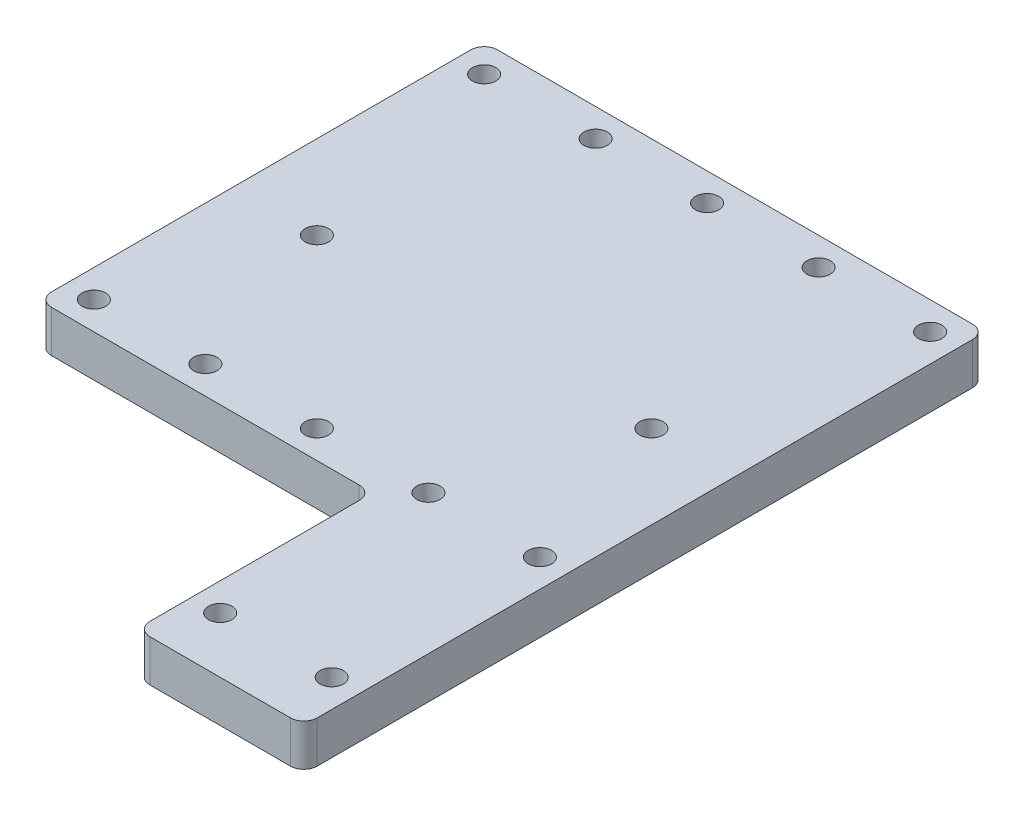
ISO-10303-21;
HEADER;
FILE_DESCRIPTION(('STEP AP214'),'2;1');
FILE_NAME('part.step','',(''),(''),'','','');
FILE_SCHEMA(('AUTOMOTIVE_DESIGN { 1 0 10303 214 1 1 1 1 }'));
ENDSEC;
DATA;
#1=APPLICATION_CONTEXT('core data for automotive mechanical design processes');
#2=APPLICATION_PROTOCOL_DEFINITION('international standard','automotive_design',2000,#1);
#3=PRODUCT_CONTEXT('',#1,'mechanical');
#4=PRODUCT('Part','Part','',(#3));
#5=PRODUCT_RELATED_PRODUCT_CATEGORY('part','',(#4));
#6=PRODUCT_DEFINITION_FORMATION('','',#4);
#7=PRODUCT_DEFINITION_CONTEXT('part definition',#1,'design');
#8=PRODUCT_DEFINITION('design','',#6,#7);
#9=PRODUCT_DEFINITION_SHAPE('','',#8);
#10=(LENGTH_UNIT() NAMED_UNIT(*) SI_UNIT(.MILLI.,.METRE.));
#11=(NAMED_UNIT(*) PLANE_ANGLE_UNIT() SI_UNIT($,.RADIAN.));
#12=(NAMED_UNIT(*) SI_UNIT($,.STERADIAN.) SOLID_ANGLE_UNIT());
#13=UNCERTAINTY_MEASURE_WITH_UNIT(LENGTH_MEASURE(1.E-05),#10,'distance_accuracy_value','');
#14=(GEOMETRIC_REPRESENTATION_CONTEXT(3) GLOBAL_UNCERTAINTY_ASSIGNED_CONTEXT((#13)) GLOBAL_UNIT_ASSIGNED_CONTEXT((#10,
#11,#12)) REPRESENTATION_CONTEXT('',''));
#15=CARTESIAN_POINT('',(0.,0.,0.));
#16=DIRECTION('',(0.,0.,1.));
#17=DIRECTION('',(1.,0.,0.));
#18=AXIS2_PLACEMENT_3D('',#15,#16,#17);
#19=CARTESIAN_POINT('',(0.,9.525,0.));
#20=DIRECTION('',(0.,1.,0.));
#21=DIRECTION('',(0.,0.,1.));
#22=AXIS2_PLACEMENT_3D('',#19,#20,#21);
#23=PLANE('',#22);
#24=CARTESIAN_POINT('',(4.25007251614318E-13,9.525,-21.2661500000001));
#25=DIRECTION('',(0.,1.,0.));
#26=DIRECTION('',(0.,0.,1.));
#27=AXIS2_PLACEMENT_3D('',#24,#25,#26);
#28=CIRCLE('',#27,2.667);
#29=CARTESIAN_POINT('',(4.25007251614318E-13,9.525,-18.5991500000001));
#30=VERTEX_POINT('',#29);
#31=EDGE_CURVE('E153',#30,#30,#28,.F.);
#32=ORIENTED_EDGE('',*,*,#31,.T.);
#33=EDGE_LOOP('',(#32));
#34=FACE_BOUND('',#33,.T.);
#35=CARTESIAN_POINT('',(-76.1999999999996,9.525,-21.2661500000005));
#36=DIRECTION('',(0.,1.,0.));
#37=DIRECTION('',(0.,0.,1.));
#38=AXIS2_PLACEMENT_3D('',#35,#36,#37);
#39=CIRCLE('',#38,2.667);
#40=CARTESIAN_POINT('',(-76.1999999999996,9.525,-18.5991500000005));
#41=VERTEX_POINT('',#40);
#42=EDGE_CURVE('E616',#41,#41,#39,.F.);
#43=ORIENTED_EDGE('',*,*,#42,.T.);
#44=EDGE_LOOP('',(#43));
#45=FACE_BOUND('',#44,.T.);
#46=CARTESIAN_POINT('',(-22.098,9.52500000000001,26.2318500000016));
#47=DIRECTION('',(0.,1.,0.));
#48=DIRECTION('',(0.,0.,1.));
#49=AXIS2_PLACEMENT_3D('',#46,#47,#48);
#50=CIRCLE('',#49,3.048);
#51=CARTESIAN_POINT('',(-22.098,9.52500000000001,23.1838500000016));
#52=VERTEX_POINT('',#51);
#53=CARTESIAN_POINT('',(-19.05,9.52500000000001,26.2318500000016));
#54=VERTEX_POINT('',#53);
#55=EDGE_CURVE('E341',#52,#54,#50,.F.);
#56=ORIENTED_EDGE('',*,*,#55,.T.);
#57=DIRECTION('',(0.,0.,1.));
#58=VECTOR('',#57,1.);
#59=CARTESIAN_POINT('',(-19.05,9.525,-78.41615));
#60=LINE('',#59,#58);
#61=CARTESIAN_POINT('',(-19.05,9.525,73.90765));
#62=VERTEX_POINT('',#61);
#63=EDGE_CURVE('E142',#54,#62,#60,.T.);
#64=ORIENTED_EDGE('',*,*,#63,.T.);
#65=CARTESIAN_POINT('',(-16.0019999999999,9.525,73.90765));
#66=DIRECTION('',(0.,1.,0.));
#67=DIRECTION('',(0.,0.,1.));
#68=AXIS2_PLACEMENT_3D('',#65,#66,#67);
#69=CIRCLE('',#68,3.04800000000007);
#70=CARTESIAN_POINT('',(-16.0019999999999,9.525,76.95565));
#71=VERTEX_POINT('',#70);
#72=EDGE_CURVE('E182',#62,#71,#69,.T.);
#73=ORIENTED_EDGE('',*,*,#72,.T.);
#74=DIRECTION('',(1.,0.,0.));
#75=VECTOR('',#74,1.);
#76=CARTESIAN_POINT('',(0.,9.525,76.95565));
#77=LINE('',#76,#75);
#78=CARTESIAN_POINT('',(16.0020000000001,9.525,76.95565));
#79=VERTEX_POINT('',#78);
#80=EDGE_CURVE('E190',#71,#79,#77,.T.);
#81=ORIENTED_EDGE('',*,*,#80,.T.);
#82=CARTESIAN_POINT('',(16.0020000000001,9.525,73.90765));
#83=DIRECTION('',(0.,1.,0.));
#84=DIRECTION('',(0.,0.,1.));
#85=AXIS2_PLACEMENT_3D('',#82,#83,#84);
#86=CIRCLE('',#85,3.04799999999995);
#87=CARTESIAN_POINT('',(19.05,9.525,73.90765));
#88=VERTEX_POINT('',#87);
#89=EDGE_CURVE('E186',#88,#79,#86,.F.);
#90=ORIENTED_EDGE('',*,*,#89,.F.);
#91=DIRECTION('',(0.,0.,-1.));
#92=VECTOR('',#91,1.);
#93=CARTESIAN_POINT('',(19.05,9.525,-78.41615));
#94=LINE('',#93,#92);
#95=CARTESIAN_POINT('',(19.05,9.525,-75.36815));
#96=VERTEX_POINT('',#95);
#97=EDGE_CURVE('E64',#88,#96,#94,.T.);
#98=ORIENTED_EDGE('',*,*,#97,.T.);
#99=CARTESIAN_POINT('',(16.002,9.525,-75.36815));
#100=DIRECTION('',(0.,1.,0.));
#101=DIRECTION('',(0.,0.,1.));
#102=AXIS2_PLACEMENT_3D('',#99,#100,#101);
#103=CIRCLE('',#102,3.048);
#104=CARTESIAN_POINT('',(16.002,9.525,-78.41615));
#105=VERTEX_POINT('',#104);
#106=EDGE_CURVE('E136',#96,#105,#103,.T.);
#107=ORIENTED_EDGE('',*,*,#106,.T.);
#108=DIRECTION('',(-1.,0.,0.));
#109=VECTOR('',#108,1.);
#110=CARTESIAN_POINT('',(-19.05,9.525,-78.41615));
#111=LINE('',#110,#109);
#112=CARTESIAN_POINT('',(-92.202,9.52500000000001,-78.4161500000005));
#113=VERTEX_POINT('',#112);
#114=EDGE_CURVE('E129',#105,#113,#111,.T.);
#115=ORIENTED_EDGE('',*,*,#114,.T.);
#116=CARTESIAN_POINT('',(-92.202,9.52500000000001,-75.3681500000001));
#117=DIRECTION('',(0.,1.,0.));
#118=DIRECTION('',(0.,0.,1.));
#119=AXIS2_PLACEMENT_3D('',#116,#117,#118);
#120=CIRCLE('',#119,3.04800000000035);
#121=CARTESIAN_POINT('',(-95.25,9.52500000000001,-75.3681499999998));
#122=VERTEX_POINT('',#121);
#123=EDGE_CURVE('E134',#122,#113,#120,.F.);
#124=ORIENTED_EDGE('',*,*,#123,.F.);
#125=DIRECTION('',(0.,0.,1.));
#126=VECTOR('',#125,1.);
#127=CARTESIAN_POINT('',(-95.25,9.52500000000001,0.));
#128=LINE('',#127,#126);
#129=CARTESIAN_POINT('',(-95.25,9.52500000000001,20.1358500000002));
#130=VERTEX_POINT('',#129);
#131=EDGE_CURVE('E344',#122,#130,#128,.T.);
#132=ORIENTED_EDGE('',*,*,#131,.T.);
#133=CARTESIAN_POINT('',(-92.2020000000002,9.52500000000001,20.1358500000002));
#134=DIRECTION('',(0.,1.,0.));
#135=DIRECTION('',(0.,0.,1.));
#136=AXIS2_PLACEMENT_3D('',#133,#134,#135);
#137=CIRCLE('',#136,3.04800000000001);
#138=CARTESIAN_POINT('',(-92.2020000000002,9.52500000000001,23.1838500000015));
#139=VERTEX_POINT('',#138);
#140=EDGE_CURVE('E348',#130,#139,#137,.T.);
#141=ORIENTED_EDGE('',*,*,#140,.T.);
#142=DIRECTION('',(-1.,0.,0.));
#143=VECTOR('',#142,1.);
#144=CARTESIAN_POINT('',(0.,9.52500000000001,23.1838500000016));
#145=LINE('',#144,#143);
#146=EDGE_CURVE('E173',#52,#139,#145,.T.);
#147=ORIENTED_EDGE('',*,*,#146,.F.);
#148=EDGE_LOOP('',(#56,#64,#73,#81,#90,#98,#107,#115,#124,#132,#141,#147));
#149=FACE_BOUND('',#148,.T.);
#150=CARTESIAN_POINT('',(12.7,9.525,16.83385));
#151=DIRECTION('',(0.,1.,0.));
#152=DIRECTION('',(0.,0.,1.));
#153=AXIS2_PLACEMENT_3D('',#150,#151,#152);
#154=CIRCLE('',#153,2.667);
#155=CARTESIAN_POINT('',(12.7,9.525,19.50085));
#156=VERTEX_POINT('',#155);
#157=EDGE_CURVE('E211',#156,#156,#154,.T.);
#158=ORIENTED_EDGE('',*,*,#157,.F.);
#159=EDGE_LOOP('',(#158));
#160=FACE_BOUND('',#159,.T.);
#161=CARTESIAN_POINT('',(12.7,9.525,-72.06615));
#162=DIRECTION('',(0.,1.,0.));
#163=DIRECTION('',(0.,0.,1.));
#164=AXIS2_PLACEMENT_3D('',#161,#162,#163);
#165=CIRCLE('',#164,2.667);
#166=CARTESIAN_POINT('',(12.7,9.525,-69.39915));
#167=VERTEX_POINT('',#166);
#168=EDGE_CURVE('E216',#167,#167,#165,.T.);
#169=ORIENTED_EDGE('',*,*,#168,.F.);
#170=EDGE_LOOP('',(#169));
#171=FACE_BOUND('',#170,.T.);
#172=CARTESIAN_POINT('',(-12.7,9.525,-72.06615));
#173=DIRECTION('',(0.,1.,0.));
#174=DIRECTION('',(0.,0.,1.));
#175=AXIS2_PLACEMENT_3D('',#172,#173,#174);
#176=CIRCLE('',#175,2.667);
#177=CARTESIAN_POINT('',(-12.7,9.525,-69.39915));
#178=VERTEX_POINT('',#177);
#179=EDGE_CURVE('E220',#178,#178,#176,.T.);
#180=ORIENTED_EDGE('',*,*,#179,.F.);
#181=EDGE_LOOP('',(#180));
#182=FACE_BOUND('',#181,.T.);
#183=CARTESIAN_POINT('',(-12.7,9.525,64.25565));
#184=DIRECTION('',(0.,1.,0.));
#185=DIRECTION('',(0.,0.,1.));
#186=AXIS2_PLACEMENT_3D('',#183,#184,#185);
#187=CIRCLE('',#186,2.667);
#188=CARTESIAN_POINT('',(-12.7,9.525,66.92265));
#189=VERTEX_POINT('',#188);
#190=EDGE_CURVE('E210',#189,#189,#187,.T.);
#191=ORIENTED_EDGE('',*,*,#190,.F.);
#192=EDGE_LOOP('',(#191));
#193=FACE_BOUND('',#192,.T.);
#194=CARTESIAN_POINT('',(12.7,9.525,64.25565));
#195=DIRECTION('',(0.,1.,0.));
#196=DIRECTION('',(0.,0.,1.));
#197=AXIS2_PLACEMENT_3D('',#194,#195,#196);
#198=CIRCLE('',#197,2.667);
#199=CARTESIAN_POINT('',(12.7,9.525,66.92265));
#200=VERTEX_POINT('',#199);
#201=EDGE_CURVE('E198',#200,#200,#198,.T.);
#202=ORIENTED_EDGE('',*,*,#201,.F.);
#203=EDGE_LOOP('',(#202));
#204=FACE_BOUND('',#203,.T.);
#205=CARTESIAN_POINT('',(-12.7,9.525,16.83385));
#206=DIRECTION('',(0.,1.,0.));
#207=DIRECTION('',(0.,0.,1.));
#208=AXIS2_PLACEMENT_3D('',#205,#206,#207);
#209=CIRCLE('',#208,2.667);
#210=CARTESIAN_POINT('',(-12.7,9.525,19.50085));
#211=VERTEX_POINT('',#210);
#212=EDGE_CURVE('E215',#211,#211,#209,.T.);
#213=ORIENTED_EDGE('',*,*,#212,.F.);
#214=EDGE_LOOP('',(#213));
#215=FACE_BOUND('',#214,.T.);
#216=CARTESIAN_POINT('',(-63.5,9.52500000000001,16.8338499999996));
#217=DIRECTION('',(0.,1.,0.));
#218=DIRECTION('',(0.,0.,1.));
#219=AXIS2_PLACEMENT_3D('',#216,#217,#218);
#220=CIRCLE('',#219,2.667);
#221=CARTESIAN_POINT('',(-63.5,9.52500000000001,19.5008499999996));
#222=VERTEX_POINT('',#221);
#223=EDGE_CURVE('E304',#222,#222,#220,.F.);
#224=ORIENTED_EDGE('',*,*,#223,.T.);
#225=EDGE_LOOP('',(#224));
#226=FACE_BOUND('',#225,.T.);
#227=CARTESIAN_POINT('',(-88.9,9.52500000000001,16.8338499999994));
#228=DIRECTION('',(0.,1.,0.));
#229=DIRECTION('',(0.,0.,1.));
#230=AXIS2_PLACEMENT_3D('',#227,#228,#229);
#231=CIRCLE('',#230,2.667);
#232=CARTESIAN_POINT('',(-88.9,9.52500000000001,19.5008499999994));
#233=VERTEX_POINT('',#232);
#234=EDGE_CURVE('E310',#233,#233,#231,.F.);
#235=ORIENTED_EDGE('',*,*,#234,.T.);
#236=EDGE_LOOP('',(#235));
#237=FACE_BOUND('',#236,.T.);
#238=CARTESIAN_POINT('',(-38.1,9.52500000000001,16.8338499999998));
#239=DIRECTION('',(0.,1.,0.));
#240=DIRECTION('',(0.,0.,1.));
#241=AXIS2_PLACEMENT_3D('',#238,#239,#240);
#242=CIRCLE('',#241,2.667);
#243=CARTESIAN_POINT('',(-38.1,9.52500000000001,19.5008499999998));
#244=VERTEX_POINT('',#243);
#245=EDGE_CURVE('E337',#244,#244,#242,.F.);
#246=ORIENTED_EDGE('',*,*,#245,.T.);
#247=EDGE_LOOP('',(#246));
#248=FACE_BOUND('',#247,.T.);
#249=CARTESIAN_POINT('',(-88.9,9.52500000000001,-72.0661500000005));
#250=DIRECTION('',(0.,1.,0.));
#251=DIRECTION('',(0.,0.,1.));
#252=AXIS2_PLACEMENT_3D('',#249,#250,#251);
#253=CIRCLE('',#252,2.66700000000001);
#254=CARTESIAN_POINT('',(-88.9,9.52500000000001,-69.3991500000005));
#255=VERTEX_POINT('',#254);
#256=EDGE_CURVE('E333',#255,#255,#253,.F.);
#257=ORIENTED_EDGE('',*,*,#256,.T.);
#258=EDGE_LOOP('',(#257));
#259=FACE_BOUND('',#258,.T.);
#260=CARTESIAN_POINT('',(-63.5,9.52500000000001,-72.0661500000004));
#261=DIRECTION('',(0.,1.,0.));
#262=DIRECTION('',(0.,0.,1.));
#263=AXIS2_PLACEMENT_3D('',#260,#261,#262);
#264=CIRCLE('',#263,2.667);
#265=CARTESIAN_POINT('',(-63.5,9.52500000000001,-69.3991500000004));
#266=VERTEX_POINT('',#265);
#267=EDGE_CURVE('E329',#266,#266,#264,.F.);
#268=ORIENTED_EDGE('',*,*,#267,.T.);
#269=EDGE_LOOP('',(#268));
#270=FACE_BOUND('',#269,.T.);
#271=CARTESIAN_POINT('',(-38.1,9.52500000000001,-72.0661500000002));
#272=DIRECTION('',(0.,1.,0.));
#273=DIRECTION('',(0.,0.,1.));
#274=AXIS2_PLACEMENT_3D('',#271,#272,#273);
#275=CIRCLE('',#274,2.667);
#276=CARTESIAN_POINT('',(-38.1,9.52500000000001,-69.3991500000002));
#277=VERTEX_POINT('',#276);
#278=EDGE_CURVE('E187',#277,#277,#275,.F.);
#279=ORIENTED_EDGE('',*,*,#278,.T.);
#280=EDGE_LOOP('',(#279));
#281=FACE_BOUND('',#280,.T.);
#282=ADVANCED_FACE('F40',(#34,#45,#149,#160,#171,#182,#193,#204,#215,#226,#237,#248,#259,#270,
#281),#23,.T.);
#283=CARTESIAN_POINT('',(0.,0.,0.));
#284=DIRECTION('',(0.,1.,0.));
#285=DIRECTION('',(0.,0.,1.));
#286=AXIS2_PLACEMENT_3D('',#283,#284,#285);
#287=PLANE('',#286);
#288=CARTESIAN_POINT('',(4.25007251614318E-13,0.,-21.2661500000001));
#289=DIRECTION('',(0.,-1.,0.));
#290=DIRECTION('',(0.,0.,-1.));
#291=AXIS2_PLACEMENT_3D('',#288,#289,#290);
#292=CIRCLE('',#291,2.667);
#293=CARTESIAN_POINT('',(4.25007251614318E-13,0.,-23.9331500000001));
#294=VERTEX_POINT('',#293);
#295=EDGE_CURVE('E608',#294,#294,#292,.T.);
#296=ORIENTED_EDGE('',*,*,#295,.F.);
#297=EDGE_LOOP('',(#296));
#298=FACE_BOUND('',#297,.T.);
#299=CARTESIAN_POINT('',(-76.1999999999996,0.,-21.2661500000005));
#300=DIRECTION('',(0.,-1.,0.));
#301=DIRECTION('',(0.,0.,-1.));
#302=AXIS2_PLACEMENT_3D('',#299,#300,#301);
#303=CIRCLE('',#302,2.667);
#304=CARTESIAN_POINT('',(-76.1999999999996,0.,-23.9331500000005));
#305=VERTEX_POINT('',#304);
#306=EDGE_CURVE('E613',#305,#305,#303,.T.);
#307=ORIENTED_EDGE('',*,*,#306,.F.);
#308=EDGE_LOOP('',(#307));
#309=FACE_BOUND('',#308,.T.);
#310=DIRECTION('',(0.,0.,1.));
#311=VECTOR('',#310,1.);
#312=CARTESIAN_POINT('',(-19.05,0.,-78.41615));
#313=LINE('',#312,#311);
#314=CARTESIAN_POINT('',(-19.05,0.,26.2318500000016));
#315=VERTEX_POINT('',#314);
#316=CARTESIAN_POINT('',(-19.05,0.,73.90765));
#317=VERTEX_POINT('',#316);
#318=EDGE_CURVE('E232',#315,#317,#313,.T.);
#319=ORIENTED_EDGE('',*,*,#318,.F.);
#320=CARTESIAN_POINT('',(-22.098,0.,26.2318500000016));
#321=DIRECTION('',(0.,-1.,0.));
#322=DIRECTION('',(0.,0.,-1.));
#323=AXIS2_PLACEMENT_3D('',#320,#321,#322);
#324=CIRCLE('',#323,3.048);
#325=CARTESIAN_POINT('',(-22.098,0.,23.1838500000016));
#326=VERTEX_POINT('',#325);
#327=EDGE_CURVE('E176',#326,#315,#324,.T.);
#328=ORIENTED_EDGE('',*,*,#327,.F.);
#329=DIRECTION('',(-1.,0.,0.));
#330=VECTOR('',#329,1.);
#331=CARTESIAN_POINT('',(0.,0.,23.1838500000016));
#332=LINE('',#331,#330);
#333=CARTESIAN_POINT('',(-92.2020000000002,0.,23.1838500000015));
#334=VERTEX_POINT('',#333);
#335=EDGE_CURVE('E305',#326,#334,#332,.T.);
#336=ORIENTED_EDGE('',*,*,#335,.T.);
#337=CARTESIAN_POINT('',(-92.2020000000002,0.,20.1358500000002));
#338=DIRECTION('',(0.,-1.,0.));
#339=DIRECTION('',(0.,0.,-1.));
#340=AXIS2_PLACEMENT_3D('',#337,#338,#339);
#341=CIRCLE('',#340,3.04800000000001);
#342=CARTESIAN_POINT('',(-95.25,0.,20.1358500000002));
#343=VERTEX_POINT('',#342);
#344=EDGE_CURVE('E168',#343,#334,#341,.F.);
#345=ORIENTED_EDGE('',*,*,#344,.F.);
#346=DIRECTION('',(0.,0.,1.));
#347=VECTOR('',#346,1.);
#348=CARTESIAN_POINT('',(-95.25,0.,0.));
#349=LINE('',#348,#347);
#350=CARTESIAN_POINT('',(-95.25,0.,-75.3681499999998));
#351=VERTEX_POINT('',#350);
#352=EDGE_CURVE('E161',#351,#343,#349,.T.);
#353=ORIENTED_EDGE('',*,*,#352,.F.);
#354=CARTESIAN_POINT('',(-92.202,0.,-75.3681500000001));
#355=DIRECTION('',(0.,-1.,0.));
#356=DIRECTION('',(0.,0.,-1.));
#357=AXIS2_PLACEMENT_3D('',#354,#355,#356);
#358=CIRCLE('',#357,3.04800000000035);
#359=CARTESIAN_POINT('',(-92.202,0.,-78.4161500000005));
#360=VERTEX_POINT('',#359);
#361=EDGE_CURVE('E300',#351,#360,#358,.T.);
#362=ORIENTED_EDGE('',*,*,#361,.T.);
#363=DIRECTION('',(-1.,0.,0.));
#364=VECTOR('',#363,1.);
#365=CARTESIAN_POINT('',(-19.05,0.,-78.41615));
#366=LINE('',#365,#364);
#367=CARTESIAN_POINT('',(16.002,0.,-78.41615));
#368=VERTEX_POINT('',#367);
#369=EDGE_CURVE('E157',#368,#360,#366,.T.);
#370=ORIENTED_EDGE('',*,*,#369,.F.);
#371=CARTESIAN_POINT('',(16.002,0.,-75.36815));
#372=DIRECTION('',(0.,1.,0.));
#373=DIRECTION('',(0.,0.,1.));
#374=AXIS2_PLACEMENT_3D('',#371,#372,#373);
#375=CIRCLE('',#374,3.048);
#376=CARTESIAN_POINT('',(19.05,0.,-75.36815));
#377=VERTEX_POINT('',#376);
#378=EDGE_CURVE('E247',#368,#377,#375,.F.);
#379=ORIENTED_EDGE('',*,*,#378,.T.);
#380=DIRECTION('',(0.,0.,-1.));
#381=VECTOR('',#380,1.);
#382=CARTESIAN_POINT('',(19.05,0.,-78.41615));
#383=LINE('',#382,#381);
#384=CARTESIAN_POINT('',(19.05,0.,73.90765));
#385=VERTEX_POINT('',#384);
#386=EDGE_CURVE('E237',#385,#377,#383,.T.);
#387=ORIENTED_EDGE('',*,*,#386,.F.);
#388=CARTESIAN_POINT('',(16.0020000000001,0.,73.90765));
#389=DIRECTION('',(0.,1.,0.));
#390=DIRECTION('',(0.,0.,1.));
#391=AXIS2_PLACEMENT_3D('',#388,#389,#390);
#392=CIRCLE('',#391,3.04799999999995);
#393=CARTESIAN_POINT('',(16.0020000000001,0.,76.95565));
#394=VERTEX_POINT('',#393);
#395=EDGE_CURVE('E256',#385,#394,#392,.F.);
#396=ORIENTED_EDGE('',*,*,#395,.T.);
#397=DIRECTION('',(1.,0.,0.));
#398=VECTOR('',#397,1.);
#399=CARTESIAN_POINT('',(0.,0.,76.95565));
#400=LINE('',#399,#398);
#401=CARTESIAN_POINT('',(-16.0019999999999,0.,76.95565));
#402=VERTEX_POINT('',#401);
#403=EDGE_CURVE('E49',#402,#394,#400,.T.);
#404=ORIENTED_EDGE('',*,*,#403,.F.);
#405=CARTESIAN_POINT('',(-16.0019999999999,0.,73.90765));
#406=DIRECTION('',(0.,1.,0.));
#407=DIRECTION('',(0.,0.,1.));
#408=AXIS2_PLACEMENT_3D('',#405,#406,#407);
#409=CIRCLE('',#408,3.04800000000007);
#410=EDGE_CURVE('E11',#317,#402,#409,.T.);
#411=ORIENTED_EDGE('',*,*,#410,.F.);
#412=EDGE_LOOP('',(#319,#328,#336,#345,#353,#362,#370,#379,#387,#396,#404,#411));
#413=FACE_BOUND('',#412,.T.);
#414=CARTESIAN_POINT('',(-12.7,0.,16.83385));
#415=DIRECTION('',(0.,1.,0.));
#416=DIRECTION('',(0.,0.,1.));
#417=AXIS2_PLACEMENT_3D('',#414,#415,#416);
#418=CIRCLE('',#417,2.667);
#419=CARTESIAN_POINT('',(-12.7,0.,19.50085));
#420=VERTEX_POINT('',#419);
#421=EDGE_CURVE('E230',#420,#420,#418,.T.);
#422=ORIENTED_EDGE('',*,*,#421,.T.);
#423=EDGE_LOOP('',(#422));
#424=FACE_BOUND('',#423,.T.);
#425=CARTESIAN_POINT('',(12.7,0.,64.25565));
#426=DIRECTION('',(0.,1.,0.));
#427=DIRECTION('',(0.,0.,1.));
#428=AXIS2_PLACEMENT_3D('',#425,#426,#427);
#429=CIRCLE('',#428,2.667);
#430=CARTESIAN_POINT('',(12.7,0.,66.92265));
#431=VERTEX_POINT('',#430);
#432=EDGE_CURVE('E260',#431,#431,#429,.T.);
#433=ORIENTED_EDGE('',*,*,#432,.T.);
#434=EDGE_LOOP('',(#433));
#435=FACE_BOUND('',#434,.T.);
#436=CARTESIAN_POINT('',(-12.7,0.,64.25565));
#437=DIRECTION('',(0.,1.,0.));
#438=DIRECTION('',(0.,0.,1.));
#439=AXIS2_PLACEMENT_3D('',#436,#437,#438);
#440=CIRCLE('',#439,2.667);
#441=CARTESIAN_POINT('',(-12.7,0.,66.92265));
#442=VERTEX_POINT('',#441);
#443=EDGE_CURVE('E264',#442,#442,#440,.T.);
#444=ORIENTED_EDGE('',*,*,#443,.T.);
#445=EDGE_LOOP('',(#444));
#446=FACE_BOUND('',#445,.T.);
#447=CARTESIAN_POINT('',(-12.7,0.,-72.06615));
#448=DIRECTION('',(0.,1.,0.));
#449=DIRECTION('',(0.,0.,1.));
#450=AXIS2_PLACEMENT_3D('',#447,#448,#449);
#451=CIRCLE('',#450,2.667);
#452=CARTESIAN_POINT('',(-12.7,0.,-69.39915));
#453=VERTEX_POINT('',#452);
#454=EDGE_CURVE('E268',#453,#453,#451,.T.);
#455=ORIENTED_EDGE('',*,*,#454,.T.);
#456=EDGE_LOOP('',(#455));
#457=FACE_BOUND('',#456,.T.);
#458=CARTESIAN_POINT('',(12.7,0.,-72.06615));
#459=DIRECTION('',(0.,1.,0.));
#460=DIRECTION('',(0.,0.,1.));
#461=AXIS2_PLACEMENT_3D('',#458,#459,#460);
#462=CIRCLE('',#461,2.667);
#463=CARTESIAN_POINT('',(12.7,0.,-69.39915));
#464=VERTEX_POINT('',#463);
#465=EDGE_CURVE('E272',#464,#464,#462,.T.);
#466=ORIENTED_EDGE('',*,*,#465,.T.);
#467=EDGE_LOOP('',(#466));
#468=FACE_BOUND('',#467,.T.);
#469=CARTESIAN_POINT('',(12.7,0.,16.83385));
#470=DIRECTION('',(0.,1.,0.));
#471=DIRECTION('',(0.,0.,1.));
#472=AXIS2_PLACEMENT_3D('',#469,#470,#471);
#473=CIRCLE('',#472,2.667);
#474=CARTESIAN_POINT('',(12.7,0.,19.50085));
#475=VERTEX_POINT('',#474);
#476=EDGE_CURVE('E240',#475,#475,#473,.T.);
#477=ORIENTED_EDGE('',*,*,#476,.T.);
#478=EDGE_LOOP('',(#477));
#479=FACE_BOUND('',#478,.T.);
#480=CARTESIAN_POINT('',(-88.9,0.,-72.0661500000005));
#481=DIRECTION('',(0.,-1.,0.));
#482=DIRECTION('',(0.,0.,-1.));
#483=AXIS2_PLACEMENT_3D('',#480,#481,#482);
#484=CIRCLE('',#483,2.66700000000001);
#485=CARTESIAN_POINT('',(-88.9,0.,-74.7331500000006));
#486=VERTEX_POINT('',#485);
#487=EDGE_CURVE('E317',#486,#486,#484,.T.);
#488=ORIENTED_EDGE('',*,*,#487,.F.);
#489=EDGE_LOOP('',(#488));
#490=FACE_BOUND('',#489,.T.);
#491=CARTESIAN_POINT('',(-88.9,0.,16.8338499999994));
#492=DIRECTION('',(0.,-1.,0.));
#493=DIRECTION('',(0.,0.,-1.));
#494=AXIS2_PLACEMENT_3D('',#491,#492,#493);
#495=CIRCLE('',#494,2.667);
#496=CARTESIAN_POINT('',(-88.9,0.,14.1668499999994));
#497=VERTEX_POINT('',#496);
#498=EDGE_CURVE('E636',#497,#497,#495,.T.);
#499=ORIENTED_EDGE('',*,*,#498,.F.);
#500=EDGE_LOOP('',(#499));
#501=FACE_BOUND('',#500,.T.);
#502=CARTESIAN_POINT('',(-63.5,0.,-72.0661500000004));
#503=DIRECTION('',(0.,-1.,0.));
#504=DIRECTION('',(0.,0.,-1.));
#505=AXIS2_PLACEMENT_3D('',#502,#503,#504);
#506=CIRCLE('',#505,2.667);
#507=CARTESIAN_POINT('',(-63.5,0.,-74.7331500000004));
#508=VERTEX_POINT('',#507);
#509=EDGE_CURVE('E633',#508,#508,#506,.T.);
#510=ORIENTED_EDGE('',*,*,#509,.F.);
#511=EDGE_LOOP('',(#510));
#512=FACE_BOUND('',#511,.T.);
#513=CARTESIAN_POINT('',(-63.5,0.,16.8338499999996));
#514=DIRECTION('',(0.,-1.,0.));
#515=DIRECTION('',(0.,0.,-1.));
#516=AXIS2_PLACEMENT_3D('',#513,#514,#515);
#517=CIRCLE('',#516,2.667);
#518=CARTESIAN_POINT('',(-63.5,0.,14.1668499999996));
#519=VERTEX_POINT('',#518);
#520=EDGE_CURVE('E629',#519,#519,#517,.T.);
#521=ORIENTED_EDGE('',*,*,#520,.F.);
#522=EDGE_LOOP('',(#521));
#523=FACE_BOUND('',#522,.T.);
#524=CARTESIAN_POINT('',(-38.1,0.,-72.0661500000002));
#525=DIRECTION('',(0.,-1.,0.));
#526=DIRECTION('',(0.,0.,-1.));
#527=AXIS2_PLACEMENT_3D('',#524,#525,#526);
#528=CIRCLE('',#527,2.667);
#529=CARTESIAN_POINT('',(-38.1,0.,-74.7331500000002));
#530=VERTEX_POINT('',#529);
#531=EDGE_CURVE('E181',#530,#530,#528,.T.);
#532=ORIENTED_EDGE('',*,*,#531,.F.);
#533=EDGE_LOOP('',(#532));
#534=FACE_BOUND('',#533,.T.);
#535=CARTESIAN_POINT('',(-38.1,0.,16.8338499999998));
#536=DIRECTION('',(0.,-1.,0.));
#537=DIRECTION('',(0.,0.,-1.));
#538=AXIS2_PLACEMENT_3D('',#535,#536,#537);
#539=CIRCLE('',#538,2.667);
#540=CARTESIAN_POINT('',(-38.1,0.,14.1668499999998));
#541=VERTEX_POINT('',#540);
#542=EDGE_CURVE('E313',#541,#541,#539,.T.);
#543=ORIENTED_EDGE('',*,*,#542,.F.);
#544=EDGE_LOOP('',(#543));
#545=FACE_BOUND('',#544,.T.);
#546=ADVANCED_FACE('F291',(#298,#309,#413,#424,#435,#446,#457,#468,#479,#490,#501,#512,#523,
#534,#545),#287,.F.);
#547=CARTESIAN_POINT('',(19.05,9.525,-78.41615));
#548=DIRECTION('',(-1.,0.,0.));
#549=DIRECTION('',(0.,0.,1.));
#550=AXIS2_PLACEMENT_3D('',#547,#548,#549);
#551=PLANE('',#550);
#552=ORIENTED_EDGE('',*,*,#97,.F.);
#553=DIRECTION('',(0.,1.,0.));
#554=VECTOR('',#553,1.);
#555=CARTESIAN_POINT('',(19.05,-20.193,73.90765));
#556=LINE('',#555,#554);
#557=EDGE_CURVE('E201',#385,#88,#556,.T.);
#558=ORIENTED_EDGE('',*,*,#557,.F.);
#559=ORIENTED_EDGE('',*,*,#386,.T.);
#560=DIRECTION('',(0.,-1.,0.));
#561=VECTOR('',#560,1.);
#562=CARTESIAN_POINT('',(19.05,9.525,-75.36815));
#563=LINE('',#562,#561);
#564=EDGE_CURVE('E251',#377,#96,#563,.F.);
#565=ORIENTED_EDGE('',*,*,#564,.T.);
#566=EDGE_LOOP('',(#552,#558,#559,#565));
#567=FACE_BOUND('',#566,.T.);
#568=ADVANCED_FACE('F296',(#567),#551,.F.);
#569=CARTESIAN_POINT('',(-19.05,9.525,-78.41615));
#570=DIRECTION('',(0.,0.,1.));
#571=DIRECTION('',(1.,0.,0.));
#572=AXIS2_PLACEMENT_3D('',#569,#570,#571);
#573=PLANE('',#572);
#574=ORIENTED_EDGE('',*,*,#114,.F.);
#575=DIRECTION('',(0.,-1.,0.));
#576=VECTOR('',#575,1.);
#577=CARTESIAN_POINT('',(16.002,9.525,-78.41615));
#578=LINE('',#577,#576);
#579=EDGE_CURVE('E236',#105,#368,#578,.T.);
#580=ORIENTED_EDGE('',*,*,#579,.T.);
#581=ORIENTED_EDGE('',*,*,#369,.T.);
#582=DIRECTION('',(0.,-1.,0.));
#583=VECTOR('',#582,1.);
#584=CARTESIAN_POINT('',(-92.202,140.793615472246,-78.4161500000005));
#585=LINE('',#584,#583);
#586=EDGE_CURVE('E149',#113,#360,#585,.T.);
#587=ORIENTED_EDGE('',*,*,#586,.F.);
#588=EDGE_LOOP('',(#574,#580,#581,#587));
#589=FACE_BOUND('',#588,.T.);
#590=ADVANCED_FACE('F155',(#589),#573,.F.);
#591=CARTESIAN_POINT('',(-19.05,9.525,-78.41615));
#592=DIRECTION('',(1.,0.,0.));
#593=DIRECTION('',(0.,0.,-1.));
#594=AXIS2_PLACEMENT_3D('',#591,#592,#593);
#595=PLANE('',#594);
#596=ORIENTED_EDGE('',*,*,#63,.F.);
#597=DIRECTION('',(0.,-1.,0.));
#598=VECTOR('',#597,1.);
#599=CARTESIAN_POINT('',(-19.05,140.793615472246,26.2318500000016));
#600=LINE('',#599,#598);
#601=EDGE_CURVE('E177',#54,#315,#600,.T.);
#602=ORIENTED_EDGE('',*,*,#601,.T.);
#603=ORIENTED_EDGE('',*,*,#318,.T.);
#604=DIRECTION('',(0.,1.,0.));
#605=VECTOR('',#604,1.);
#606=CARTESIAN_POINT('',(-19.05,-20.193,73.90765));
#607=LINE('',#606,#605);
#608=EDGE_CURVE('E194',#317,#62,#607,.T.);
#609=ORIENTED_EDGE('',*,*,#608,.T.);
#610=EDGE_LOOP('',(#596,#602,#603,#609));
#611=FACE_BOUND('',#610,.T.);
#612=ADVANCED_FACE('F369',(#611),#595,.F.);
#613=CARTESIAN_POINT('',(16.002,9.525,-75.36815));
#614=DIRECTION('',(0.,-1.,0.));
#615=DIRECTION('',(0.,0.,-1.));
#616=AXIS2_PLACEMENT_3D('',#613,#614,#615);
#617=CYLINDRICAL_SURFACE('',#616,3.048);
#618=ORIENTED_EDGE('',*,*,#106,.F.);
#619=ORIENTED_EDGE('',*,*,#564,.F.);
#620=ORIENTED_EDGE('',*,*,#378,.F.);
#621=ORIENTED_EDGE('',*,*,#579,.F.);
#622=EDGE_LOOP('',(#618,#619,#620,#621));
#623=FACE_BOUND('',#622,.T.);
#624=ADVANCED_FACE('F42',(#623),#617,.T.);
#625=CARTESIAN_POINT('',(-12.7,-15.875,16.83385));
#626=DIRECTION('',(0.,1.,0.));
#627=DIRECTION('',(0.,0.,1.));
#628=AXIS2_PLACEMENT_3D('',#625,#626,#627);
#629=CYLINDRICAL_SURFACE('',#628,2.667);
#630=ORIENTED_EDGE('',*,*,#212,.T.);
#631=EDGE_LOOP('',(#630));
#632=FACE_BOUND('',#631,.T.);
#633=ORIENTED_EDGE('',*,*,#421,.F.);
#634=EDGE_LOOP('',(#633));
#635=FACE_BOUND('',#634,.T.);
#636=ADVANCED_FACE('F399',(#632,#635),#629,.F.);
#637=CARTESIAN_POINT('',(12.7,-15.875,64.25565));
#638=DIRECTION('',(0.,1.,0.));
#639=DIRECTION('',(0.,0.,1.));
#640=AXIS2_PLACEMENT_3D('',#637,#638,#639);
#641=CYLINDRICAL_SURFACE('',#640,2.667);
#642=ORIENTED_EDGE('',*,*,#201,.T.);
#643=EDGE_LOOP('',(#642));
#644=FACE_BOUND('',#643,.T.);
#645=ORIENTED_EDGE('',*,*,#432,.F.);
#646=EDGE_LOOP('',(#645));
#647=FACE_BOUND('',#646,.T.);
#648=ADVANCED_FACE('F430',(#644,#647),#641,.F.);
#649=CARTESIAN_POINT('',(-12.7,-15.875,64.25565));
#650=DIRECTION('',(0.,1.,0.));
#651=DIRECTION('',(0.,0.,1.));
#652=AXIS2_PLACEMENT_3D('',#649,#650,#651);
#653=CYLINDRICAL_SURFACE('',#652,2.667);
#654=ORIENTED_EDGE('',*,*,#190,.T.);
#655=EDGE_LOOP('',(#654));
#656=FACE_BOUND('',#655,.T.);
#657=ORIENTED_EDGE('',*,*,#443,.F.);
#658=EDGE_LOOP('',(#657));
#659=FACE_BOUND('',#658,.T.);
#660=ADVANCED_FACE('F437',(#656,#659),#653,.F.);
#661=CARTESIAN_POINT('',(-12.7,-15.875,-72.06615));
#662=DIRECTION('',(0.,1.,0.));
#663=DIRECTION('',(0.,0.,1.));
#664=AXIS2_PLACEMENT_3D('',#661,#662,#663);
#665=CYLINDRICAL_SURFACE('',#664,2.667);
#666=ORIENTED_EDGE('',*,*,#179,.T.);
#667=EDGE_LOOP('',(#666));
#668=FACE_BOUND('',#667,.T.);
#669=ORIENTED_EDGE('',*,*,#454,.F.);
#670=EDGE_LOOP('',(#669));
#671=FACE_BOUND('',#670,.T.);
#672=ADVANCED_FACE('F445',(#668,#671),#665,.F.);
#673=CARTESIAN_POINT('',(12.7,-15.875,-72.06615));
#674=DIRECTION('',(0.,1.,0.));
#675=DIRECTION('',(0.,0.,1.));
#676=AXIS2_PLACEMENT_3D('',#673,#674,#675);
#677=CYLINDRICAL_SURFACE('',#676,2.667);
#678=ORIENTED_EDGE('',*,*,#168,.T.);
#679=EDGE_LOOP('',(#678));
#680=FACE_BOUND('',#679,.T.);
#681=ORIENTED_EDGE('',*,*,#465,.F.);
#682=EDGE_LOOP('',(#681));
#683=FACE_BOUND('',#682,.T.);
#684=ADVANCED_FACE('F452',(#680,#683),#677,.F.);
#685=CARTESIAN_POINT('',(12.7,-15.875,16.83385));
#686=DIRECTION('',(0.,1.,0.));
#687=DIRECTION('',(0.,0.,1.));
#688=AXIS2_PLACEMENT_3D('',#685,#686,#687);
#689=CYLINDRICAL_SURFACE('',#688,2.667);
#690=ORIENTED_EDGE('',*,*,#157,.T.);
#691=EDGE_LOOP('',(#690));
#692=FACE_BOUND('',#691,.T.);
#693=ORIENTED_EDGE('',*,*,#476,.F.);
#694=EDGE_LOOP('',(#693));
#695=FACE_BOUND('',#694,.T.);
#696=ADVANCED_FACE('F460',(#692,#695),#689,.F.);
#697=CARTESIAN_POINT('',(-16.0019999999999,-20.193,73.90765));
#698=DIRECTION('',(0.,1.,0.));
#699=DIRECTION('',(0.,0.,1.));
#700=AXIS2_PLACEMENT_3D('',#697,#698,#699);
#701=CYLINDRICAL_SURFACE('',#700,3.04800000000007);
#702=ORIENTED_EDGE('',*,*,#410,.T.);
#703=DIRECTION('',(0.,1.,0.));
#704=VECTOR('',#703,1.);
#705=CARTESIAN_POINT('',(-16.0019999999999,-20.193,76.95565));
#706=LINE('',#705,#704);
#707=EDGE_CURVE('E195',#402,#71,#706,.T.);
#708=ORIENTED_EDGE('',*,*,#707,.T.);
#709=ORIENTED_EDGE('',*,*,#72,.F.);
#710=ORIENTED_EDGE('',*,*,#608,.F.);
#711=EDGE_LOOP('',(#702,#708,#709,#710));
#712=FACE_BOUND('',#711,.T.);
#713=ADVANCED_FACE('F372',(#712),#701,.T.);
#714=CARTESIAN_POINT('',(0.,-20.193,76.95565));
#715=DIRECTION('',(0.,0.,1.));
#716=DIRECTION('',(1.,0.,0.));
#717=AXIS2_PLACEMENT_3D('',#714,#715,#716);
#718=PLANE('',#717);
#719=ORIENTED_EDGE('',*,*,#403,.T.);
#720=DIRECTION('',(0.,1.,0.));
#721=VECTOR('',#720,1.);
#722=CARTESIAN_POINT('',(16.0020000000001,-20.193,76.95565));
#723=LINE('',#722,#721);
#724=EDGE_CURVE('E56',#394,#79,#723,.T.);
#725=ORIENTED_EDGE('',*,*,#724,.T.);
#726=ORIENTED_EDGE('',*,*,#80,.F.);
#727=ORIENTED_EDGE('',*,*,#707,.F.);
#728=EDGE_LOOP('',(#719,#725,#726,#727));
#729=FACE_BOUND('',#728,.T.);
#730=ADVANCED_FACE('F285',(#729),#718,.T.);
#731=CARTESIAN_POINT('',(16.0020000000001,-20.193,73.90765));
#732=DIRECTION('',(0.,1.,0.));
#733=DIRECTION('',(0.,0.,1.));
#734=AXIS2_PLACEMENT_3D('',#731,#732,#733);
#735=CYLINDRICAL_SURFACE('',#734,3.04799999999995);
#736=ORIENTED_EDGE('',*,*,#557,.T.);
#737=ORIENTED_EDGE('',*,*,#89,.T.);
#738=ORIENTED_EDGE('',*,*,#724,.F.);
#739=ORIENTED_EDGE('',*,*,#395,.F.);
#740=EDGE_LOOP('',(#736,#737,#738,#739));
#741=FACE_BOUND('',#740,.T.);
#742=ADVANCED_FACE('F294',(#741),#735,.T.);
#743=CARTESIAN_POINT('',(-92.202,140.793615472246,-75.3681500000001));
#744=DIRECTION('',(0.,-1.,0.));
#745=DIRECTION('',(0.,0.,-1.));
#746=AXIS2_PLACEMENT_3D('',#743,#744,#745);
#747=CYLINDRICAL_SURFACE('',#746,3.04800000000035);
#748=DIRECTION('',(0.,-1.,0.));
#749=VECTOR('',#748,1.);
#750=CARTESIAN_POINT('',(-95.25,140.793615472246,-75.3681499999998));
#751=LINE('',#750,#749);
#752=EDGE_CURVE('E151',#122,#351,#751,.T.);
#753=ORIENTED_EDGE('',*,*,#752,.F.);
#754=ORIENTED_EDGE('',*,*,#123,.T.);
#755=ORIENTED_EDGE('',*,*,#586,.T.);
#756=ORIENTED_EDGE('',*,*,#361,.F.);
#757=EDGE_LOOP('',(#753,#754,#755,#756));
#758=FACE_BOUND('',#757,.T.);
#759=ADVANCED_FACE('F147',(#758),#747,.T.);
#760=CARTESIAN_POINT('',(-95.25,140.793615472246,0.));
#761=DIRECTION('',(1.,0.,0.));
#762=DIRECTION('',(0.,0.,-1.));
#763=AXIS2_PLACEMENT_3D('',#760,#761,#762);
#764=PLANE('',#763);
#765=ORIENTED_EDGE('',*,*,#131,.F.);
#766=ORIENTED_EDGE('',*,*,#752,.T.);
#767=ORIENTED_EDGE('',*,*,#352,.T.);
#768=DIRECTION('',(0.,-1.,0.));
#769=VECTOR('',#768,1.);
#770=CARTESIAN_POINT('',(-95.25,140.793615472246,20.1358500000002));
#771=LINE('',#770,#769);
#772=EDGE_CURVE('E165',#130,#343,#771,.T.);
#773=ORIENTED_EDGE('',*,*,#772,.F.);
#774=EDGE_LOOP('',(#765,#766,#767,#773));
#775=FACE_BOUND('',#774,.T.);
#776=ADVANCED_FACE('F357',(#775),#764,.F.);
#777=CARTESIAN_POINT('',(-92.2020000000002,140.793615472246,20.1358500000002));
#778=DIRECTION('',(0.,-1.,0.));
#779=DIRECTION('',(0.,0.,-1.));
#780=AXIS2_PLACEMENT_3D('',#777,#778,#779);
#781=CYLINDRICAL_SURFACE('',#780,3.04800000000001);
#782=ORIENTED_EDGE('',*,*,#140,.F.);
#783=ORIENTED_EDGE('',*,*,#772,.T.);
#784=ORIENTED_EDGE('',*,*,#344,.T.);
#785=DIRECTION('',(0.,-1.,0.));
#786=VECTOR('',#785,1.);
#787=CARTESIAN_POINT('',(-92.2020000000002,140.793615472246,23.1838500000015));
#788=LINE('',#787,#786);
#789=EDGE_CURVE('E169',#139,#334,#788,.T.);
#790=ORIENTED_EDGE('',*,*,#789,.F.);
#791=EDGE_LOOP('',(#782,#783,#784,#790));
#792=FACE_BOUND('',#791,.T.);
#793=ADVANCED_FACE('F359',(#792),#781,.T.);
#794=CARTESIAN_POINT('',(0.,140.793615472246,23.1838500000016));
#795=DIRECTION('',(0.,0.,1.));
#796=DIRECTION('',(1.,0.,0.));
#797=AXIS2_PLACEMENT_3D('',#794,#795,#796);
#798=PLANE('',#797);
#799=DIRECTION('',(0.,-1.,0.));
#800=VECTOR('',#799,1.);
#801=CARTESIAN_POINT('',(-22.098,140.793615472246,23.1838500000016));
#802=LINE('',#801,#800);
#803=EDGE_CURVE('E172',#52,#326,#802,.T.);
#804=ORIENTED_EDGE('',*,*,#803,.F.);
#805=ORIENTED_EDGE('',*,*,#146,.T.);
#806=ORIENTED_EDGE('',*,*,#789,.T.);
#807=ORIENTED_EDGE('',*,*,#335,.F.);
#808=EDGE_LOOP('',(#804,#805,#806,#807));
#809=FACE_BOUND('',#808,.T.);
#810=ADVANCED_FACE('F364',(#809),#798,.T.);
#811=CARTESIAN_POINT('',(-22.098,140.793615472246,26.2318500000016));
#812=DIRECTION('',(0.,-1.,0.));
#813=DIRECTION('',(0.,0.,-1.));
#814=AXIS2_PLACEMENT_3D('',#811,#812,#813);
#815=CYLINDRICAL_SURFACE('',#814,3.048);
#816=ORIENTED_EDGE('',*,*,#55,.F.);
#817=ORIENTED_EDGE('',*,*,#803,.T.);
#818=ORIENTED_EDGE('',*,*,#327,.T.);
#819=ORIENTED_EDGE('',*,*,#601,.F.);
#820=EDGE_LOOP('',(#816,#817,#818,#819));
#821=FACE_BOUND('',#820,.T.);
#822=ADVANCED_FACE('F374',(#821),#815,.F.);
#823=CARTESIAN_POINT('',(-38.1,140.793615472246,-72.0661500000002));
#824=DIRECTION('',(0.,-1.,0.));
#825=DIRECTION('',(0.,0.,-1.));
#826=AXIS2_PLACEMENT_3D('',#823,#824,#825);
#827=CYLINDRICAL_SURFACE('',#826,2.667);
#828=ORIENTED_EDGE('',*,*,#531,.T.);
#829=EDGE_LOOP('',(#828));
#830=FACE_BOUND('',#829,.T.);
#831=ORIENTED_EDGE('',*,*,#278,.F.);
#832=EDGE_LOOP('',(#831));
#833=FACE_BOUND('',#832,.T.);
#834=ADVANCED_FACE('F376',(#830,#833),#827,.F.);
#835=CARTESIAN_POINT('',(-63.5,140.793615472246,16.8338499999996));
#836=DIRECTION('',(0.,-1.,0.));
#837=DIRECTION('',(0.,0.,-1.));
#838=AXIS2_PLACEMENT_3D('',#835,#836,#837);
#839=CYLINDRICAL_SURFACE('',#838,2.667);
#840=ORIENTED_EDGE('',*,*,#520,.T.);
#841=EDGE_LOOP('',(#840));
#842=FACE_BOUND('',#841,.T.);
#843=ORIENTED_EDGE('',*,*,#223,.F.);
#844=EDGE_LOOP('',(#843));
#845=FACE_BOUND('',#844,.T.);
#846=ADVANCED_FACE('F382',(#842,#845),#839,.F.);
#847=CARTESIAN_POINT('',(-63.5,140.793615472246,-72.0661500000004));
#848=DIRECTION('',(0.,-1.,0.));
#849=DIRECTION('',(0.,0.,-1.));
#850=AXIS2_PLACEMENT_3D('',#847,#848,#849);
#851=CYLINDRICAL_SURFACE('',#850,2.667);
#852=ORIENTED_EDGE('',*,*,#509,.T.);
#853=EDGE_LOOP('',(#852));
#854=FACE_BOUND('',#853,.T.);
#855=ORIENTED_EDGE('',*,*,#267,.F.);
#856=EDGE_LOOP('',(#855));
#857=FACE_BOUND('',#856,.T.);
#858=ADVANCED_FACE('F544',(#854,#857),#851,.F.);
#859=CARTESIAN_POINT('',(-88.9,140.793615472246,16.8338499999994));
#860=DIRECTION('',(0.,-1.,0.));
#861=DIRECTION('',(0.,0.,-1.));
#862=AXIS2_PLACEMENT_3D('',#859,#860,#861);
#863=CYLINDRICAL_SURFACE('',#862,2.667);
#864=ORIENTED_EDGE('',*,*,#498,.T.);
#865=EDGE_LOOP('',(#864));
#866=FACE_BOUND('',#865,.T.);
#867=ORIENTED_EDGE('',*,*,#234,.F.);
#868=EDGE_LOOP('',(#867));
#869=FACE_BOUND('',#868,.T.);
#870=ADVANCED_FACE('F554',(#866,#869),#863,.F.);
#871=CARTESIAN_POINT('',(-88.9,140.793615472246,-72.0661500000005));
#872=DIRECTION('',(0.,-1.,0.));
#873=DIRECTION('',(0.,0.,-1.));
#874=AXIS2_PLACEMENT_3D('',#871,#872,#873);
#875=CYLINDRICAL_SURFACE('',#874,2.66700000000001);
#876=ORIENTED_EDGE('',*,*,#487,.T.);
#877=EDGE_LOOP('',(#876));
#878=FACE_BOUND('',#877,.T.);
#879=ORIENTED_EDGE('',*,*,#256,.F.);
#880=EDGE_LOOP('',(#879));
#881=FACE_BOUND('',#880,.T.);
#882=ADVANCED_FACE('F564',(#878,#881),#875,.F.);
#883=CARTESIAN_POINT('',(-38.1,140.793615472246,16.8338499999998));
#884=DIRECTION('',(0.,-1.,0.));
#885=DIRECTION('',(0.,0.,-1.));
#886=AXIS2_PLACEMENT_3D('',#883,#884,#885);
#887=CYLINDRICAL_SURFACE('',#886,2.667);
#888=ORIENTED_EDGE('',*,*,#542,.T.);
#889=EDGE_LOOP('',(#888));
#890=FACE_BOUND('',#889,.T.);
#891=ORIENTED_EDGE('',*,*,#245,.F.);
#892=EDGE_LOOP('',(#891));
#893=FACE_BOUND('',#892,.T.);
#894=ADVANCED_FACE('F573',(#890,#893),#887,.F.);
#895=CARTESIAN_POINT('',(-76.1999999999996,17.0684151416981,-21.2661500000005));
#896=DIRECTION('',(0.,-1.,0.));
#897=DIRECTION('',(0.,0.,-1.));
#898=AXIS2_PLACEMENT_3D('',#895,#896,#897);
#899=CYLINDRICAL_SURFACE('',#898,2.667);
#900=ORIENTED_EDGE('',*,*,#306,.T.);
#901=EDGE_LOOP('',(#900));
#902=FACE_BOUND('',#901,.T.);
#903=ORIENTED_EDGE('',*,*,#42,.F.);
#904=EDGE_LOOP('',(#903));
#905=FACE_BOUND('',#904,.T.);
#906=ADVANCED_FACE('F581',(#902,#905),#899,.F.);
#907=CARTESIAN_POINT('',(4.25007251614318E-13,17.0684151416981,-21.2661500000001));
#908=DIRECTION('',(0.,-1.,0.));
#909=DIRECTION('',(0.,0.,-1.));
#910=AXIS2_PLACEMENT_3D('',#907,#908,#909);
#911=CYLINDRICAL_SURFACE('',#910,2.667);
#912=ORIENTED_EDGE('',*,*,#295,.T.);
#913=EDGE_LOOP('',(#912));
#914=FACE_BOUND('',#913,.T.);
#915=ORIENTED_EDGE('',*,*,#31,.F.);
#916=EDGE_LOOP('',(#915));
#917=FACE_BOUND('',#916,.T.);
#918=ADVANCED_FACE('F591',(#914,#917),#911,.F.);
#919=CLOSED_SHELL('',(#282,#546,#568,#590,#612,#624,#636,#648,#660,#672,#684,#696,#713,#730,
#742,#759,#776,#793,#810,#822,#834,#846,#858,#870,#882,#894,#906,#918));
#920=MANIFOLD_SOLID_BREP('B2',#919);
#921=ADVANCED_BREP_SHAPE_REPRESENTATION('',(#18,#920),#14);
#922=SHAPE_DEFINITION_REPRESENTATION(#9,#921);
ENDSEC;
END-ISO-10303-21;
